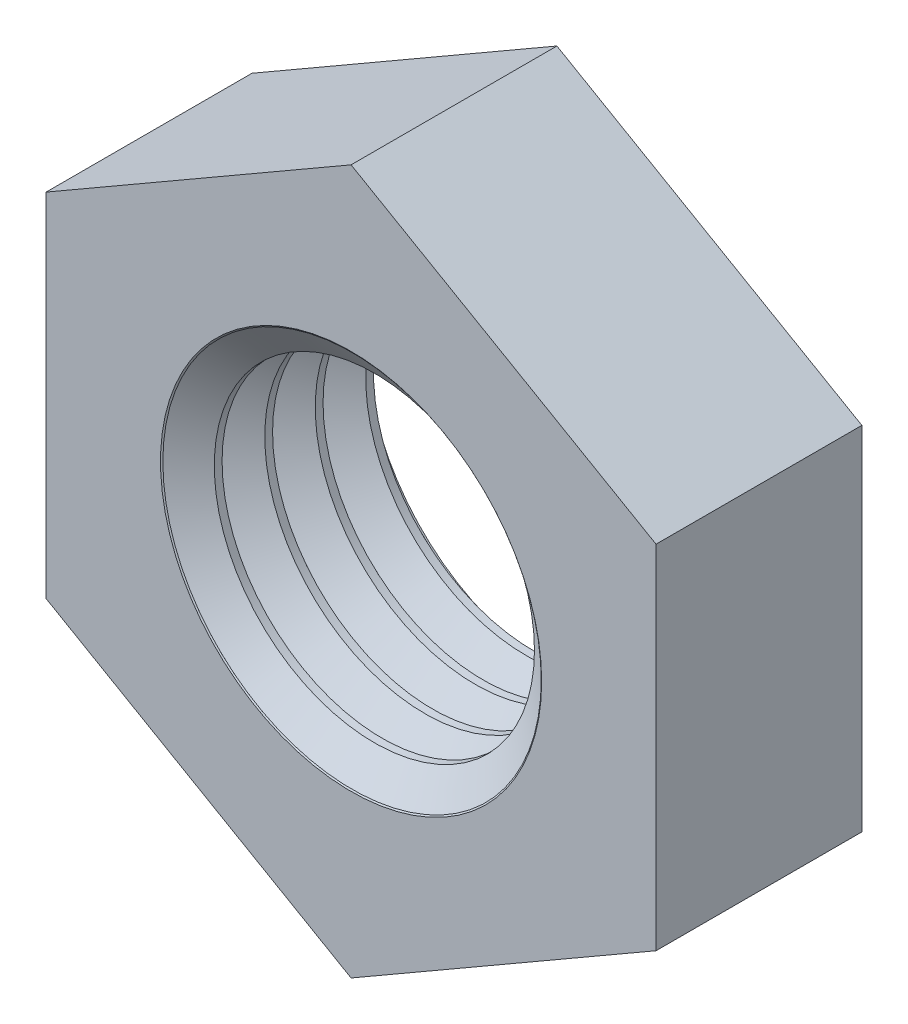
ISO-10303-21;
HEADER;
FILE_DESCRIPTION(('STEP AP214'),'2;1');
FILE_NAME('part.step','',(''),(''),'','','');
FILE_SCHEMA(('AUTOMOTIVE_DESIGN { 1 0 10303 214 1 1 1 1 }'));
ENDSEC;
DATA;
#1=APPLICATION_CONTEXT('core data for automotive mechanical design processes');
#2=APPLICATION_PROTOCOL_DEFINITION('international standard','automotive_design',2000,#1);
#3=PRODUCT_CONTEXT('',#1,'mechanical');
#4=PRODUCT('Part','Part','',(#3));
#5=PRODUCT_RELATED_PRODUCT_CATEGORY('part','',(#4));
#6=PRODUCT_DEFINITION_FORMATION('','',#4);
#7=PRODUCT_DEFINITION_CONTEXT('part definition',#1,'design');
#8=PRODUCT_DEFINITION('design','',#6,#7);
#9=PRODUCT_DEFINITION_SHAPE('','',#8);
#10=(LENGTH_UNIT() NAMED_UNIT(*) SI_UNIT(.MILLI.,.METRE.));
#11=(NAMED_UNIT(*) PLANE_ANGLE_UNIT() SI_UNIT($,.RADIAN.));
#12=(NAMED_UNIT(*) SI_UNIT($,.STERADIAN.) SOLID_ANGLE_UNIT());
#13=UNCERTAINTY_MEASURE_WITH_UNIT(LENGTH_MEASURE(1.E-05),#10,'distance_accuracy_value','');
#14=(GEOMETRIC_REPRESENTATION_CONTEXT(3) GLOBAL_UNCERTAINTY_ASSIGNED_CONTEXT((#13)) GLOBAL_UNIT_ASSIGNED_CONTEXT((#10,
#11,#12)) REPRESENTATION_CONTEXT('',''));
#15=CARTESIAN_POINT('',(0.,0.,0.));
#16=DIRECTION('',(0.,0.,1.));
#17=DIRECTION('',(1.,0.,0.));
#18=AXIS2_PLACEMENT_3D('',#15,#16,#17);
#19=CARTESIAN_POINT('',(0.,0.,-2.7));
#20=DIRECTION('',(0.,0.,1.));
#21=DIRECTION('',(1.,0.,0.));
#22=AXIS2_PLACEMENT_3D('',#19,#20,#21);
#23=CYLINDRICAL_SURFACE('',#22,2.1);
#24=CARTESIAN_POINT('',(0.,0.,-2.29238301528389));
#25=DIRECTION('',(0.,0.,-1.));
#26=DIRECTION('',(-1.,0.,0.));
#27=AXIS2_PLACEMENT_3D('',#24,#25,#26);
#28=CIRCLE('',#27,2.1);
#29=CARTESIAN_POINT('',(2.1,0.,-2.29238301528389));
#30=VERTEX_POINT('',#29);
#31=EDGE_CURVE('E221',#30,#30,#28,.T.);
#32=CARTESIAN_POINT('',(0.,0.,-2.39451698471612));
#33=DIRECTION('',(0.,0.,-1.));
#34=DIRECTION('',(-1.,0.,0.));
#35=AXIS2_PLACEMENT_3D('',#32,#33,#34);
#36=CIRCLE('',#35,2.1);
#37=CARTESIAN_POINT('',(2.1,0.,-2.39451698471611));
#38=VERTEX_POINT('',#37);
#39=EDGE_CURVE('E145',#38,#38,#36,.F.);
#40=CARTESIAN_POINT('',(2.1,0.,-2.29238301528389));
#41=CARTESIAN_POINT('',(2.1,0.,-2.29344691079881));
#42=CARTESIAN_POINT('',(2.1,0.,-2.29451080631372));
#43=CARTESIAN_POINT('',(2.1,0.,-2.29663859734356));
#44=CARTESIAN_POINT('',(2.1,0.,-2.29770249285848));
#45=CARTESIAN_POINT('',(2.1,0.,-2.29983028388832));
#46=CARTESIAN_POINT('',(2.1,0.,-2.30089417940324));
#47=CARTESIAN_POINT('',(2.1,0.,-2.30302197043308));
#48=CARTESIAN_POINT('',(2.1,0.,-2.304085865948));
#49=CARTESIAN_POINT('',(2.1,0.,-2.30621365697783));
#50=CARTESIAN_POINT('',(2.1,0.,-2.30727755249275));
#51=CARTESIAN_POINT('',(2.1,0.,-2.30940534352259));
#52=CARTESIAN_POINT('',(2.1,0.,-2.31046923903751));
#53=CARTESIAN_POINT('',(2.1,0.,-2.31259703006735));
#54=CARTESIAN_POINT('',(2.1,0.,-2.31366092558227));
#55=CARTESIAN_POINT('',(2.1,0.,-2.31578871661211));
#56=CARTESIAN_POINT('',(2.1,0.,-2.31685261212702));
#57=CARTESIAN_POINT('',(2.1,0.,-2.31898040315686));
#58=CARTESIAN_POINT('',(2.1,0.,-2.32004429867178));
#59=CARTESIAN_POINT('',(2.1,0.,-2.32217208970162));
#60=CARTESIAN_POINT('',(2.1,0.,-2.32323598521654));
#61=CARTESIAN_POINT('',(2.1,0.,-2.32536377624638));
#62=CARTESIAN_POINT('',(2.1,0.,-2.3264276717613));
#63=CARTESIAN_POINT('',(2.1,0.,-2.32855546279113));
#64=CARTESIAN_POINT('',(2.1,0.,-2.32961935830605));
#65=CARTESIAN_POINT('',(2.1,0.,-2.33174714933589));
#66=CARTESIAN_POINT('',(2.1,0.,-2.33281104485081));
#67=CARTESIAN_POINT('',(2.1,0.,-2.33493883588065));
#68=CARTESIAN_POINT('',(2.1,0.,-2.33600273139557));
#69=CARTESIAN_POINT('',(2.1,0.,-2.33813052242541));
#70=CARTESIAN_POINT('',(2.1,0.,-2.33919441794033));
#71=CARTESIAN_POINT('',(2.1,0.,-2.34132220897016));
#72=CARTESIAN_POINT('',(2.1,0.,-2.34238610448508));
#73=CARTESIAN_POINT('',(2.1,0.,-2.34451389551492));
#74=CARTESIAN_POINT('',(2.1,0.,-2.34557779102984));
#75=CARTESIAN_POINT('',(2.1,0.,-2.34770558205968));
#76=CARTESIAN_POINT('',(2.1,0.,-2.3487694775746));
#77=CARTESIAN_POINT('',(2.1,0.,-2.35089726860443));
#78=CARTESIAN_POINT('',(2.1,0.,-2.35196116411935));
#79=CARTESIAN_POINT('',(2.1,0.,-2.35408895514919));
#80=CARTESIAN_POINT('',(2.1,0.,-2.35515285066411));
#81=CARTESIAN_POINT('',(2.1,0.,-2.35728064169395));
#82=CARTESIAN_POINT('',(2.1,0.,-2.35834453720887));
#83=CARTESIAN_POINT('',(2.1,0.,-2.36047232823871));
#84=CARTESIAN_POINT('',(2.1,0.,-2.36153622375362));
#85=CARTESIAN_POINT('',(2.1,0.,-2.36366401478346));
#86=CARTESIAN_POINT('',(2.1,0.,-2.36472791029838));
#87=CARTESIAN_POINT('',(2.1,0.,-2.36685570132822));
#88=CARTESIAN_POINT('',(2.1,0.,-2.36791959684314));
#89=CARTESIAN_POINT('',(2.1,0.,-2.37004738787298));
#90=CARTESIAN_POINT('',(2.1,0.,-2.3711112833879));
#91=CARTESIAN_POINT('',(2.1,0.,-2.37323907441773));
#92=CARTESIAN_POINT('',(2.1,0.,-2.37430296993265));
#93=CARTESIAN_POINT('',(2.1,0.,-2.37643076096249));
#94=CARTESIAN_POINT('',(2.1,0.,-2.37749465647741));
#95=CARTESIAN_POINT('',(2.1,0.,-2.37962244750725));
#96=CARTESIAN_POINT('',(2.1,0.,-2.38068634302217));
#97=CARTESIAN_POINT('',(2.1,0.,-2.38281413405201));
#98=CARTESIAN_POINT('',(2.1,0.,-2.38387802956692));
#99=CARTESIAN_POINT('',(2.1,0.,-2.38600582059676));
#100=CARTESIAN_POINT('',(2.1,0.,-2.38706971611168));
#101=CARTESIAN_POINT('',(2.1,0.,-2.38919750714152));
#102=CARTESIAN_POINT('',(2.1,0.,-2.39026140265644));
#103=CARTESIAN_POINT('',(2.1,0.,-2.39238919368628));
#104=CARTESIAN_POINT('',(2.1,0.,-2.3934530892012));
#105=CARTESIAN_POINT('',(2.1,0.,-2.39451698471611));
#106=B_SPLINE_CURVE_WITH_KNOTS('',3,(#40,#41,#42,#43,#44,#45,#46,#47,#48,#49,#50,#51,#52,#53,
#54,#55,#56,#57,#58,#59,#60,#61,#62,#63,#64,#65,#66,#67,#68,#69,#70,#71,#72,#73,#74,#75,#76,#77,
#78,#79,#80,#81,#82,#83,#84,#85,#86,#87,#88,#89,#90,#91,#92,#93,#94,#95,#96,#97,#98,#99,#100,
#101,#102,#103,#104,#105),.UNSPECIFIED.,.F.,.F.,(4,2,2,2,2,2,2,2,2,2,2,2,2,2,2,2,2,2,2,2,2,2,2,
2,2,2,2,2,2,2,2,2,4),(0.,0.00319168654475729,0.00638337308951457,0.00957505963427143,
0.0127667461790287,0.015958432723786,0.0191501192685429,0.0223418058133001,0.025533492358057,
0.0287251789028143,0.0319168654475716,0.0351085519923284,0.0383002385370857,0.0414919250818426,
0.0446836116265999,0.0478752981713571,0.051066984716114,0.0542586712608713,0.0574503578056286,
0.0606420443503854,0.0638337308951427,0.0670254174399,0.0702171039846568,0.0734087905294141,
0.076600477074171,0.0797921636189283,0.0829838501636856,0.0861755367084424,0.0893672232531997,
0.0925589097979566,0.0957505963427138,0.0989422828874711,0.102133969432228),.UNSPECIFIED.);
#107=EDGE_CURVE('BSEAM34',#30,#38,#106,.T.);
#108=ORIENTED_EDGE('',*,*,#31,.F.);
#109=ORIENTED_EDGE('',*,*,#39,.F.);
#110=ORIENTED_EDGE('',*,*,#107,.T.);
#111=ORIENTED_EDGE('',*,*,#107,.F.);
#112=EDGE_LOOP('',(#108,#110,#109,#111));
#113=FACE_BOUND('',#112,.T.);
#114=ADVANCED_FACE('F34',(#113),#23,.F.);
#115=CARTESIAN_POINT('',(0.,0.,-1.73221698471612));
#116=DIRECTION('',(0.,0.,-1.));
#117=DIRECTION('',(-1.,0.,0.));
#118=AXIS2_PLACEMENT_3D('',#115,#116,#117);
#119=CIRCLE('',#118,2.1);
#120=CARTESIAN_POINT('',(2.1,0.,-1.73221698471612));
#121=VERTEX_POINT('',#120);
#122=EDGE_CURVE('E224',#121,#121,#119,.T.);
#123=CARTESIAN_POINT('',(0.,0.,-1.63008301528389));
#124=DIRECTION('',(0.,0.,-1.));
#125=DIRECTION('',(-1.,0.,0.));
#126=AXIS2_PLACEMENT_3D('',#123,#124,#125);
#127=CIRCLE('',#126,2.1);
#128=CARTESIAN_POINT('',(2.1,0.,-1.63008301528389));
#129=VERTEX_POINT('',#128);
#130=EDGE_CURVE('E212',#129,#129,#127,.T.);
#131=CARTESIAN_POINT('',(2.1,0.,-1.73221698471612));
#132=CARTESIAN_POINT('',(2.1,0.,-1.7311530892012));
#133=CARTESIAN_POINT('',(2.1,0.,-1.73008919368628));
#134=CARTESIAN_POINT('',(2.1,0.,-1.72796140265645));
#135=CARTESIAN_POINT('',(2.1,0.,-1.72689750714153));
#136=CARTESIAN_POINT('',(2.1,0.,-1.72476971611169));
#137=CARTESIAN_POINT('',(2.1,0.,-1.72370582059677));
#138=CARTESIAN_POINT('',(2.1,0.,-1.72157802956693));
#139=CARTESIAN_POINT('',(2.1,0.,-1.72051413405201));
#140=CARTESIAN_POINT('',(2.1,0.,-1.71838634302217));
#141=CARTESIAN_POINT('',(2.1,0.,-1.71732244750725));
#142=CARTESIAN_POINT('',(2.1,0.,-1.71519465647742));
#143=CARTESIAN_POINT('',(2.1,0.,-1.7141307609625));
#144=CARTESIAN_POINT('',(2.1,0.,-1.71200296993266));
#145=CARTESIAN_POINT('',(2.1,0.,-1.71093907441774));
#146=CARTESIAN_POINT('',(2.1,0.,-1.7088112833879));
#147=CARTESIAN_POINT('',(2.1,0.,-1.70774738787298));
#148=CARTESIAN_POINT('',(2.1,0.,-1.70561959684314));
#149=CARTESIAN_POINT('',(2.1,0.,-1.70455570132822));
#150=CARTESIAN_POINT('',(2.1,0.,-1.70242791029839));
#151=CARTESIAN_POINT('',(2.1,0.,-1.70136401478347));
#152=CARTESIAN_POINT('',(2.1,0.,-1.69923622375363));
#153=CARTESIAN_POINT('',(2.1,0.,-1.69817232823871));
#154=CARTESIAN_POINT('',(2.1,0.,-1.69604453720887));
#155=CARTESIAN_POINT('',(2.1,0.,-1.69498064169395));
#156=CARTESIAN_POINT('',(2.1,0.,-1.69285285066411));
#157=CARTESIAN_POINT('',(2.1,0.,-1.6917889551492));
#158=CARTESIAN_POINT('',(2.1,0.,-1.68966116411936));
#159=CARTESIAN_POINT('',(2.1,0.,-1.68859726860444));
#160=CARTESIAN_POINT('',(2.1,0.,-1.6864694775746));
#161=CARTESIAN_POINT('',(2.1,0.,-1.68540558205968));
#162=CARTESIAN_POINT('',(2.1,0.,-1.68327779102984));
#163=CARTESIAN_POINT('',(2.1,0.,-1.68221389551492));
#164=CARTESIAN_POINT('',(2.1,0.,-1.68008610448509));
#165=CARTESIAN_POINT('',(2.1,0.,-1.67902220897017));
#166=CARTESIAN_POINT('',(2.1,0.,-1.67689441794033));
#167=CARTESIAN_POINT('',(2.1,0.,-1.67583052242541));
#168=CARTESIAN_POINT('',(2.1,0.,-1.67370273139557));
#169=CARTESIAN_POINT('',(2.1,0.,-1.67263883588065));
#170=CARTESIAN_POINT('',(2.1,0.,-1.67051104485081));
#171=CARTESIAN_POINT('',(2.1,0.,-1.66944714933589));
#172=CARTESIAN_POINT('',(2.1,0.,-1.66731935830606));
#173=CARTESIAN_POINT('',(2.1,0.,-1.66625546279114));
#174=CARTESIAN_POINT('',(2.1,0.,-1.6641276717613));
#175=CARTESIAN_POINT('',(2.1,0.,-1.66306377624638));
#176=CARTESIAN_POINT('',(2.1,0.,-1.66093598521654));
#177=CARTESIAN_POINT('',(2.1,0.,-1.65987208970162));
#178=CARTESIAN_POINT('',(2.1,0.,-1.65774429867178));
#179=CARTESIAN_POINT('',(2.1,0.,-1.65668040315687));
#180=CARTESIAN_POINT('',(2.1,0.,-1.65455261212703));
#181=CARTESIAN_POINT('',(2.1,0.,-1.65348871661211));
#182=CARTESIAN_POINT('',(2.1,0.,-1.65136092558227));
#183=CARTESIAN_POINT('',(2.1,0.,-1.65029703006735));
#184=CARTESIAN_POINT('',(2.1,0.,-1.64816923903751));
#185=CARTESIAN_POINT('',(2.1,0.,-1.64710534352259));
#186=CARTESIAN_POINT('',(2.1,0.,-1.64497755249275));
#187=CARTESIAN_POINT('',(2.1,0.,-1.64391365697784));
#188=CARTESIAN_POINT('',(2.1,0.,-1.641785865948));
#189=CARTESIAN_POINT('',(2.1,0.,-1.64072197043308));
#190=CARTESIAN_POINT('',(2.1,0.,-1.63859417940324));
#191=CARTESIAN_POINT('',(2.1,0.,-1.63753028388832));
#192=CARTESIAN_POINT('',(2.1,0.,-1.63540249285848));
#193=CARTESIAN_POINT('',(2.1,0.,-1.63433859734356));
#194=CARTESIAN_POINT('',(2.1,0.,-1.63221080631373));
#195=CARTESIAN_POINT('',(2.1,0.,-1.63114691079881));
#196=CARTESIAN_POINT('',(2.1,0.,-1.63008301528389));
#197=B_SPLINE_CURVE_WITH_KNOTS('',3,(#131,#132,#133,#134,#135,#136,#137,#138,#139,#140,#141,
#142,#143,#144,#145,#146,#147,#148,#149,#150,#151,#152,#153,#154,#155,#156,#157,#158,#159,#160,
#161,#162,#163,#164,#165,#166,#167,#168,#169,#170,#171,#172,#173,#174,#175,#176,#177,#178,#179,
#180,#181,#182,#183,#184,#185,#186,#187,#188,#189,#190,#191,#192,#193,#194,#195,#196),
.UNSPECIFIED.,.F.,.F.,(4,2,2,2,2,2,2,2,2,2,2,2,2,2,2,2,2,2,2,2,2,2,2,2,2,2,2,2,2,2,2,2,4),(0.,
0.00319168654475729,0.00638337308951457,0.00957505963427186,0.0127667461790291,
0.0159584327237864,0.0191501192685437,0.022341805813301,0.0255334923580585,0.0287251789028158,
0.0319168654475731,0.0351085519923304,0.0383002385370877,0.0414919250818449,0.0446836116266024,
0.0478752981713597,0.051066984716117,0.0542586712608743,0.0574503578056316,0.0606420443503891,
0.0638337308951464,0.0670254174399037,0.070217103984661,0.0734087905294182,0.0766004770741755,
0.079792163618933,0.0829838501636903,0.0861755367084476,0.0893672232532049,0.0925589097979622,
0.0957505963427197,0.098942282887477,0.102133969432234),.UNSPECIFIED.);
#198=EDGE_CURVE('BSEAM172',#121,#129,#197,.T.);
#199=ORIENTED_EDGE('',*,*,#122,.T.);
#200=ORIENTED_EDGE('',*,*,#130,.F.);
#201=ORIENTED_EDGE('',*,*,#198,.T.);
#202=ORIENTED_EDGE('',*,*,#198,.F.);
#203=EDGE_LOOP('',(#199,#201,#200,#202));
#204=FACE_BOUND('',#203,.T.);
#205=ADVANCED_FACE('F172',(#204),#23,.F.);
#206=CARTESIAN_POINT('',(0.,0.,-1.06991698471612));
#207=DIRECTION('',(0.,0.,-1.));
#208=DIRECTION('',(-1.,0.,0.));
#209=AXIS2_PLACEMENT_3D('',#206,#207,#208);
#210=CIRCLE('',#209,2.1);
#211=CARTESIAN_POINT('',(2.1,0.,-1.06991698471612));
#212=VERTEX_POINT('',#211);
#213=EDGE_CURVE('E215',#212,#212,#210,.T.);
#214=CARTESIAN_POINT('',(0.,0.,-0.967783015283887));
#215=DIRECTION('',(0.,0.,-1.));
#216=DIRECTION('',(-1.,0.,0.));
#217=AXIS2_PLACEMENT_3D('',#214,#215,#216);
#218=CIRCLE('',#217,2.1);
#219=CARTESIAN_POINT('',(2.1,0.,-0.967783015283887));
#220=VERTEX_POINT('',#219);
#221=EDGE_CURVE('E203',#220,#220,#218,.T.);
#222=CARTESIAN_POINT('',(2.1,0.,-1.06991698471612));
#223=CARTESIAN_POINT('',(2.1,0.,-1.0688530892012));
#224=CARTESIAN_POINT('',(2.1,0.,-1.06778919368628));
#225=CARTESIAN_POINT('',(2.1,0.,-1.06566140265645));
#226=CARTESIAN_POINT('',(2.1,0.,-1.06459750714153));
#227=CARTESIAN_POINT('',(2.1,0.,-1.06246971611169));
#228=CARTESIAN_POINT('',(2.1,0.,-1.06140582059677));
#229=CARTESIAN_POINT('',(2.1,0.,-1.05927802956693));
#230=CARTESIAN_POINT('',(2.1,0.,-1.05821413405201));
#231=CARTESIAN_POINT('',(2.1,0.,-1.05608634302217));
#232=CARTESIAN_POINT('',(2.1,0.,-1.05502244750725));
#233=CARTESIAN_POINT('',(2.1,0.,-1.05289465647742));
#234=CARTESIAN_POINT('',(2.1,0.,-1.0518307609625));
#235=CARTESIAN_POINT('',(2.1,0.,-1.04970296993266));
#236=CARTESIAN_POINT('',(2.1,0.,-1.04863907441774));
#237=CARTESIAN_POINT('',(2.1,0.,-1.0465112833879));
#238=CARTESIAN_POINT('',(2.1,0.,-1.04544738787298));
#239=CARTESIAN_POINT('',(2.1,0.,-1.04331959684314));
#240=CARTESIAN_POINT('',(2.1,0.,-1.04225570132822));
#241=CARTESIAN_POINT('',(2.1,0.,-1.04012791029839));
#242=CARTESIAN_POINT('',(2.1,0.,-1.03906401478347));
#243=CARTESIAN_POINT('',(2.1,0.,-1.03693622375363));
#244=CARTESIAN_POINT('',(2.1,0.,-1.03587232823871));
#245=CARTESIAN_POINT('',(2.1,0.,-1.03374453720887));
#246=CARTESIAN_POINT('',(2.1,0.,-1.03268064169395));
#247=CARTESIAN_POINT('',(2.1,0.,-1.03055285066412));
#248=CARTESIAN_POINT('',(2.1,0.,-1.0294889551492));
#249=CARTESIAN_POINT('',(2.1,0.,-1.02736116411936));
#250=CARTESIAN_POINT('',(2.1,0.,-1.02629726860444));
#251=CARTESIAN_POINT('',(2.1,0.,-1.0241694775746));
#252=CARTESIAN_POINT('',(2.1,0.,-1.02310558205968));
#253=CARTESIAN_POINT('',(2.1,0.,-1.02097779102984));
#254=CARTESIAN_POINT('',(2.1,0.,-1.01991389551492));
#255=CARTESIAN_POINT('',(2.1,0.,-1.01778610448509));
#256=CARTESIAN_POINT('',(2.1,0.,-1.01672220897017));
#257=CARTESIAN_POINT('',(2.1,0.,-1.01459441794033));
#258=CARTESIAN_POINT('',(2.1,0.,-1.01353052242541));
#259=CARTESIAN_POINT('',(2.1,0.,-1.01140273139557));
#260=CARTESIAN_POINT('',(2.1,0.,-1.01033883588065));
#261=CARTESIAN_POINT('',(2.1,0.,-1.00821104485081));
#262=CARTESIAN_POINT('',(2.1,0.,-1.00714714933589));
#263=CARTESIAN_POINT('',(2.1,0.,-1.00501935830606));
#264=CARTESIAN_POINT('',(2.1,0.,-1.00395546279114));
#265=CARTESIAN_POINT('',(2.1,0.,-1.0018276717613));
#266=CARTESIAN_POINT('',(2.1,0.,-1.00076377624638));
#267=CARTESIAN_POINT('',(2.1,0.,-0.998635985216542));
#268=CARTESIAN_POINT('',(2.1,0.,-0.997572089701623));
#269=CARTESIAN_POINT('',(2.1,0.,-0.995444298671784));
#270=CARTESIAN_POINT('',(2.1,0.,-0.994380403156865));
#271=CARTESIAN_POINT('',(2.1,0.,-0.992252612127027));
#272=CARTESIAN_POINT('',(2.1,0.,-0.991188716612108));
#273=CARTESIAN_POINT('',(2.1,0.,-0.98906092558227));
#274=CARTESIAN_POINT('',(2.1,0.,-0.987997030067351));
#275=CARTESIAN_POINT('',(2.1,0.,-0.985869239037512));
#276=CARTESIAN_POINT('',(2.1,0.,-0.984805343522593));
#277=CARTESIAN_POINT('',(2.1,0.,-0.982677552492755));
#278=CARTESIAN_POINT('',(2.1,0.,-0.981613656977836));
#279=CARTESIAN_POINT('',(2.1,0.,-0.979485865947998));
#280=CARTESIAN_POINT('',(2.1,0.,-0.978421970433079));
#281=CARTESIAN_POINT('',(2.1,0.,-0.97629417940324));
#282=CARTESIAN_POINT('',(2.1,0.,-0.975230283888321));
#283=CARTESIAN_POINT('',(2.1,0.,-0.973102492858483));
#284=CARTESIAN_POINT('',(2.1,0.,-0.972038597343564));
#285=CARTESIAN_POINT('',(2.1,0.,-0.969910806313726));
#286=CARTESIAN_POINT('',(2.1,0.,-0.968846910798807));
#287=CARTESIAN_POINT('',(2.1,0.,-0.967783015283887));
#288=B_SPLINE_CURVE_WITH_KNOTS('',3,(#222,#223,#224,#225,#226,#227,#228,#229,#230,#231,#232,
#233,#234,#235,#236,#237,#238,#239,#240,#241,#242,#243,#244,#245,#246,#247,#248,#249,#250,#251,
#252,#253,#254,#255,#256,#257,#258,#259,#260,#261,#262,#263,#264,#265,#266,#267,#268,#269,#270,
#271,#272,#273,#274,#275,#276,#277,#278,#279,#280,#281,#282,#283,#284,#285,#286,#287),
.UNSPECIFIED.,.F.,.F.,(4,2,2,2,2,2,2,2,2,2,2,2,2,2,2,2,2,2,2,2,2,2,2,2,2,2,2,2,2,2,2,2,4),(0.,
0.00319168654475729,0.00638337308951457,0.00957505963427208,0.0127667461790294,
0.0159584327237867,0.0191501192685439,0.0223418058133012,0.0255334923580587,0.028725178902816,
0.0319168654475733,0.0351085519923306,0.0383002385370879,0.0414919250818452,0.0446836116266027,
0.04787529817136,0.0510669847161172,0.0542586712608745,0.0574503578056318,0.0606420443503893,
0.0638337308951466,0.0670254174399039,0.0702171039846612,0.0734087905294185,0.0766004770741757,
0.0797921636189333,0.0829838501636905,0.0861755367084478,0.0893672232532051,0.0925589097979624,
0.0957505963427199,0.0989422828874772,0.102133969432234),.UNSPECIFIED.);
#289=EDGE_CURVE('BSEAM178',#212,#220,#288,.T.);
#290=ORIENTED_EDGE('',*,*,#213,.T.);
#291=ORIENTED_EDGE('',*,*,#221,.F.);
#292=ORIENTED_EDGE('',*,*,#289,.T.);
#293=ORIENTED_EDGE('',*,*,#289,.F.);
#294=EDGE_LOOP('',(#290,#292,#291,#293));
#295=FACE_BOUND('',#294,.T.);
#296=ADVANCED_FACE('F178',(#295),#23,.F.);
#297=CARTESIAN_POINT('',(0.,0.,-0.407616984716122));
#298=DIRECTION('',(0.,0.,-1.));
#299=DIRECTION('',(-1.,0.,0.));
#300=AXIS2_PLACEMENT_3D('',#297,#298,#299);
#301=CIRCLE('',#300,2.1);
#302=CARTESIAN_POINT('',(2.1,0.,-0.407616984716122));
#303=VERTEX_POINT('',#302);
#304=EDGE_CURVE('E193',#303,#303,#301,.T.);
#305=CARTESIAN_POINT('',(0.,0.,-0.305483015283887));
#306=DIRECTION('',(0.,0.,-1.));
#307=DIRECTION('',(-1.,0.,0.));
#308=AXIS2_PLACEMENT_3D('',#305,#306,#307);
#309=CIRCLE('',#308,2.1);
#310=CARTESIAN_POINT('',(2.1,0.,-0.305483015283887));
#311=VERTEX_POINT('',#310);
#312=EDGE_CURVE('E196',#311,#311,#309,.T.);
#313=CARTESIAN_POINT('',(2.1,0.,-0.407616984716122));
#314=CARTESIAN_POINT('',(2.1,0.,-0.406553089201203));
#315=CARTESIAN_POINT('',(2.1,0.,-0.405489193686284));
#316=CARTESIAN_POINT('',(2.1,0.,-0.403361402656446));
#317=CARTESIAN_POINT('',(2.1,0.,-0.402297507141527));
#318=CARTESIAN_POINT('',(2.1,0.,-0.400169716111688));
#319=CARTESIAN_POINT('',(2.1,0.,-0.399105820596769));
#320=CARTESIAN_POINT('',(2.1,0.,-0.396978029566931));
#321=CARTESIAN_POINT('',(2.1,0.,-0.395914134052012));
#322=CARTESIAN_POINT('',(2.1,0.,-0.393786343022174));
#323=CARTESIAN_POINT('',(2.1,0.,-0.392722447507254));
#324=CARTESIAN_POINT('',(2.1,0.,-0.390594656477416));
#325=CARTESIAN_POINT('',(2.1,0.,-0.389530760962497));
#326=CARTESIAN_POINT('',(2.1,0.,-0.387402969932659));
#327=CARTESIAN_POINT('',(2.1,0.,-0.38633907441774));
#328=CARTESIAN_POINT('',(2.1,0.,-0.384211283387901));
#329=CARTESIAN_POINT('',(2.1,0.,-0.383147387872982));
#330=CARTESIAN_POINT('',(2.1,0.,-0.381019596843144));
#331=CARTESIAN_POINT('',(2.1,0.,-0.379955701328225));
#332=CARTESIAN_POINT('',(2.1,0.,-0.377827910298387));
#333=CARTESIAN_POINT('',(2.1,0.,-0.376764014783468));
#334=CARTESIAN_POINT('',(2.1,0.,-0.37463622375363));
#335=CARTESIAN_POINT('',(2.1,0.,-0.373572328238711));
#336=CARTESIAN_POINT('',(2.1,0.,-0.371444537208872));
#337=CARTESIAN_POINT('',(2.1,0.,-0.370380641693953));
#338=CARTESIAN_POINT('',(2.1,0.,-0.368252850664115));
#339=CARTESIAN_POINT('',(2.1,0.,-0.367188955149195));
#340=CARTESIAN_POINT('',(2.1,0.,-0.365061164119357));
#341=CARTESIAN_POINT('',(2.1,0.,-0.363997268604438));
#342=CARTESIAN_POINT('',(2.1,0.,-0.3618694775746));
#343=CARTESIAN_POINT('',(2.1,0.,-0.360805582059681));
#344=CARTESIAN_POINT('',(2.1,0.,-0.358677791029843));
#345=CARTESIAN_POINT('',(2.1,0.,-0.357613895514924));
#346=CARTESIAN_POINT('',(2.1,0.,-0.355486104485085));
#347=CARTESIAN_POINT('',(2.1,0.,-0.354422208970166));
#348=CARTESIAN_POINT('',(2.1,0.,-0.352294417940328));
#349=CARTESIAN_POINT('',(2.1,0.,-0.351230522425409));
#350=CARTESIAN_POINT('',(2.1,0.,-0.349102731395571));
#351=CARTESIAN_POINT('',(2.1,0.,-0.348038835880652));
#352=CARTESIAN_POINT('',(2.1,0.,-0.345911044850814));
#353=CARTESIAN_POINT('',(2.1,0.,-0.344847149335894));
#354=CARTESIAN_POINT('',(2.1,0.,-0.342719358306056));
#355=CARTESIAN_POINT('',(2.1,0.,-0.341655462791137));
#356=CARTESIAN_POINT('',(2.1,0.,-0.339527671761299));
#357=CARTESIAN_POINT('',(2.1,0.,-0.338463776246379));
#358=CARTESIAN_POINT('',(2.1,0.,-0.336335985216541));
#359=CARTESIAN_POINT('',(2.1,0.,-0.335272089701622));
#360=CARTESIAN_POINT('',(2.1,0.,-0.333144298671784));
#361=CARTESIAN_POINT('',(2.1,0.,-0.332080403156865));
#362=CARTESIAN_POINT('',(2.1,0.,-0.329952612127027));
#363=CARTESIAN_POINT('',(2.1,0.,-0.328888716612108));
#364=CARTESIAN_POINT('',(2.1,0.,-0.326760925582269));
#365=CARTESIAN_POINT('',(2.1,0.,-0.32569703006735));
#366=CARTESIAN_POINT('',(2.1,0.,-0.323569239037512));
#367=CARTESIAN_POINT('',(2.1,0.,-0.322505343522593));
#368=CARTESIAN_POINT('',(2.1,0.,-0.320377552492755));
#369=CARTESIAN_POINT('',(2.1,0.,-0.319313656977835));
#370=CARTESIAN_POINT('',(2.1,0.,-0.317185865947997));
#371=CARTESIAN_POINT('',(2.1,0.,-0.316121970433078));
#372=CARTESIAN_POINT('',(2.1,0.,-0.31399417940324));
#373=CARTESIAN_POINT('',(2.1,0.,-0.312930283888321));
#374=CARTESIAN_POINT('',(2.1,0.,-0.310802492858483));
#375=CARTESIAN_POINT('',(2.1,0.,-0.309738597343563));
#376=CARTESIAN_POINT('',(2.1,0.,-0.307610806313725));
#377=CARTESIAN_POINT('',(2.1,0.,-0.306546910798806));
#378=CARTESIAN_POINT('',(2.1,0.,-0.305483015283887));
#379=B_SPLINE_CURVE_WITH_KNOTS('',3,(#313,#314,#315,#316,#317,#318,#319,#320,#321,#322,#323,
#324,#325,#326,#327,#328,#329,#330,#331,#332,#333,#334,#335,#336,#337,#338,#339,#340,#341,#342,
#343,#344,#345,#346,#347,#348,#349,#350,#351,#352,#353,#354,#355,#356,#357,#358,#359,#360,#361,
#362,#363,#364,#365,#366,#367,#368,#369,#370,#371,#372,#373,#374,#375,#376,#377,#378),
.UNSPECIFIED.,.F.,.F.,(4,2,2,2,2,2,2,2,2,2,2,2,2,2,2,2,2,2,2,2,2,2,2,2,2,2,2,2,2,2,2,2,4),(0.,
0.00319168654475729,0.00638337308951457,0.00957505963427186,0.0127667461790291,
0.0159584327237869,0.0191501192685442,0.0223418058133014,0.0255334923580587,0.028725178902816,
0.0319168654475733,0.0351085519923306,0.0383002385370883,0.0414919250818456,0.0446836116266029,
0.0478752981713602,0.0510669847161175,0.0542586712608747,0.057450357805632,0.0606420443503893,
0.0638337308951466,0.0670254174399043,0.0702171039846616,0.0734087905294189,0.0766004770741762,
0.0797921636189335,0.0829838501636908,0.086175536708448,0.0893672232532058,0.0925589097979631,
0.0957505963427203,0.0989422828874776,0.102133969432235),.UNSPECIFIED.);
#380=EDGE_CURVE('BSEAM169',#303,#311,#379,.T.);
#381=ORIENTED_EDGE('',*,*,#304,.T.);
#382=ORIENTED_EDGE('',*,*,#312,.F.);
#383=ORIENTED_EDGE('',*,*,#380,.T.);
#384=ORIENTED_EDGE('',*,*,#380,.F.);
#385=EDGE_LOOP('',(#381,#383,#382,#384));
#386=FACE_BOUND('',#385,.T.);
#387=ADVANCED_FACE('F169',(#386),#23,.F.);
#388=CARTESIAN_POINT('',(0.,4.61880215351702,-2.7));
#389=DIRECTION('',(-0.500000000000006,0.866025403784435,0.));
#390=DIRECTION('',(-0.866025403784436,-0.500000000000006,0.));
#391=AXIS2_PLACEMENT_3D('',#388,#389,#390);
#392=PLANE('',#391);
#393=DIRECTION('',(-0.866025403784435,-0.500000000000006,0.));
#394=VECTOR('',#393,1.);
#395=CARTESIAN_POINT('',(0.,4.61880215351702,0.));
#396=LINE('',#395,#394);
#397=CARTESIAN_POINT('',(0.,4.61880215351702,0.));
#398=VERTEX_POINT('',#397);
#399=CARTESIAN_POINT('',(-4.,2.30940107675848,0.));
#400=VERTEX_POINT('',#399);
#401=EDGE_CURVE('E121',#398,#400,#396,.T.);
#402=ORIENTED_EDGE('',*,*,#401,.F.);
#403=DIRECTION('',(0.,0.,1.));
#404=VECTOR('',#403,1.);
#405=CARTESIAN_POINT('',(0.,4.61880215351702,-2.7));
#406=LINE('',#405,#404);
#407=CARTESIAN_POINT('',(0.,4.61880215351702,-2.7));
#408=VERTEX_POINT('',#407);
#409=EDGE_CURVE('E11',#408,#398,#406,.T.);
#410=ORIENTED_EDGE('',*,*,#409,.F.);
#411=DIRECTION('',(-0.866025403784435,-0.500000000000006,0.));
#412=VECTOR('',#411,1.);
#413=CARTESIAN_POINT('',(0.,4.61880215351702,-2.7));
#414=LINE('',#413,#412);
#415=CARTESIAN_POINT('',(-4.,2.30940107675848,-2.7));
#416=VERTEX_POINT('',#415);
#417=EDGE_CURVE('E136',#408,#416,#414,.T.);
#418=ORIENTED_EDGE('',*,*,#417,.T.);
#419=DIRECTION('',(0.,0.,1.));
#420=VECTOR('',#419,1.);
#421=CARTESIAN_POINT('',(-4.,2.30940107675848,-2.7));
#422=LINE('',#421,#420);
#423=EDGE_CURVE('E85',#416,#400,#422,.T.);
#424=ORIENTED_EDGE('',*,*,#423,.T.);
#425=EDGE_LOOP('',(#402,#410,#418,#424));
#426=FACE_BOUND('',#425,.T.);
#427=ADVANCED_FACE('F36',(#426),#392,.T.);
#428=CARTESIAN_POINT('',(4.,2.30940107675849,-2.7));
#429=DIRECTION('',(0.500000000000004,0.866025403784436,0.));
#430=DIRECTION('',(-0.866025403784436,0.500000000000004,0.));
#431=AXIS2_PLACEMENT_3D('',#428,#429,#430);
#432=PLANE('',#431);
#433=DIRECTION('',(-0.866025403784436,0.500000000000004,0.));
#434=VECTOR('',#433,1.);
#435=CARTESIAN_POINT('',(4.,2.30940107675849,0.));
#436=LINE('',#435,#434);
#437=CARTESIAN_POINT('',(4.,2.30940107675849,0.));
#438=VERTEX_POINT('',#437);
#439=EDGE_CURVE('E134',#438,#398,#436,.T.);
#440=ORIENTED_EDGE('',*,*,#439,.F.);
#441=DIRECTION('',(0.,0.,1.));
#442=VECTOR('',#441,1.);
#443=CARTESIAN_POINT('',(4.,2.30940107675849,-2.7));
#444=LINE('',#443,#442);
#445=CARTESIAN_POINT('',(4.,2.30940107675849,-2.7));
#446=VERTEX_POINT('',#445);
#447=EDGE_CURVE('E44',#446,#438,#444,.T.);
#448=ORIENTED_EDGE('',*,*,#447,.F.);
#449=DIRECTION('',(-0.866025403784436,0.500000000000004,0.));
#450=VECTOR('',#449,1.);
#451=CARTESIAN_POINT('',(4.,2.30940107675849,-2.7));
#452=LINE('',#451,#450);
#453=EDGE_CURVE('E103',#446,#408,#452,.T.);
#454=ORIENTED_EDGE('',*,*,#453,.T.);
#455=ORIENTED_EDGE('',*,*,#409,.T.);
#456=EDGE_LOOP('',(#440,#448,#454,#455));
#457=FACE_BOUND('',#456,.T.);
#458=ADVANCED_FACE('F161',(#457),#432,.T.);
#459=CARTESIAN_POINT('',(4.,2.30940107675849,-2.7));
#460=DIRECTION('',(-1.,0.,0.));
#461=DIRECTION('',(0.,0.,1.));
#462=AXIS2_PLACEMENT_3D('',#459,#460,#461);
#463=PLANE('',#462);
#464=DIRECTION('',(0.,-1.,0.));
#465=VECTOR('',#464,1.);
#466=CARTESIAN_POINT('',(4.,2.30940107675849,0.));
#467=LINE('',#466,#465);
#468=CARTESIAN_POINT('',(4.,-2.30940107675853,0.));
#469=VERTEX_POINT('',#468);
#470=EDGE_CURVE('E107',#438,#469,#467,.T.);
#471=ORIENTED_EDGE('',*,*,#470,.T.);
#472=DIRECTION('',(0.,0.,1.));
#473=VECTOR('',#472,1.);
#474=CARTESIAN_POINT('',(4.,-2.30940107675853,-2.7));
#475=LINE('',#474,#473);
#476=CARTESIAN_POINT('',(4.,-2.30940107675853,-2.7));
#477=VERTEX_POINT('',#476);
#478=EDGE_CURVE('E105',#477,#469,#475,.T.);
#479=ORIENTED_EDGE('',*,*,#478,.F.);
#480=DIRECTION('',(0.,-1.,0.));
#481=VECTOR('',#480,1.);
#482=CARTESIAN_POINT('',(4.,2.30940107675849,-2.7));
#483=LINE('',#482,#481);
#484=EDGE_CURVE('E96',#446,#477,#483,.T.);
#485=ORIENTED_EDGE('',*,*,#484,.F.);
#486=ORIENTED_EDGE('',*,*,#447,.T.);
#487=EDGE_LOOP('',(#471,#479,#485,#486));
#488=FACE_BOUND('',#487,.T.);
#489=ADVANCED_FACE('F106',(#488),#463,.F.);
#490=CARTESIAN_POINT('',(0.,-4.61880215351707,-2.7));
#491=DIRECTION('',(0.500000000000006,-0.866025403784435,0.));
#492=DIRECTION('',(0.866025403784435,0.500000000000006,0.));
#493=AXIS2_PLACEMENT_3D('',#490,#491,#492);
#494=PLANE('',#493);
#495=DIRECTION('',(0.866025403784435,0.500000000000006,0.));
#496=VECTOR('',#495,1.);
#497=CARTESIAN_POINT('',(0.,-4.61880215351707,0.));
#498=LINE('',#497,#496);
#499=CARTESIAN_POINT('',(0.,-4.61880215351707,0.));
#500=VERTEX_POINT('',#499);
#501=EDGE_CURVE('E131',#500,#469,#498,.T.);
#502=ORIENTED_EDGE('',*,*,#501,.F.);
#503=DIRECTION('',(0.,0.,1.));
#504=VECTOR('',#503,1.);
#505=CARTESIAN_POINT('',(0.,-4.61880215351707,-2.7));
#506=LINE('',#505,#504);
#507=CARTESIAN_POINT('',(0.,-4.61880215351707,-2.7));
#508=VERTEX_POINT('',#507);
#509=EDGE_CURVE('E111',#508,#500,#506,.T.);
#510=ORIENTED_EDGE('',*,*,#509,.F.);
#511=DIRECTION('',(0.866025403784435,0.500000000000006,0.));
#512=VECTOR('',#511,1.);
#513=CARTESIAN_POINT('',(0.,-4.61880215351707,-2.7));
#514=LINE('',#513,#512);
#515=EDGE_CURVE('E101',#508,#477,#514,.T.);
#516=ORIENTED_EDGE('',*,*,#515,.T.);
#517=ORIENTED_EDGE('',*,*,#478,.T.);
#518=EDGE_LOOP('',(#502,#510,#516,#517));
#519=FACE_BOUND('',#518,.T.);
#520=ADVANCED_FACE('F113',(#519),#494,.T.);
#521=CARTESIAN_POINT('',(-4.,-2.30940107675854,-2.7));
#522=DIRECTION('',(-0.500000000000005,-0.866025403784436,0.));
#523=DIRECTION('',(0.866025403784436,-0.500000000000005,0.));
#524=AXIS2_PLACEMENT_3D('',#521,#522,#523);
#525=PLANE('',#524);
#526=DIRECTION('',(0.866025403784436,-0.500000000000004,0.));
#527=VECTOR('',#526,1.);
#528=CARTESIAN_POINT('',(-4.,-2.30940107675854,0.));
#529=LINE('',#528,#527);
#530=CARTESIAN_POINT('',(-4.,-2.30940107675854,0.));
#531=VERTEX_POINT('',#530);
#532=EDGE_CURVE('E128',#531,#500,#529,.T.);
#533=ORIENTED_EDGE('',*,*,#532,.F.);
#534=DIRECTION('',(0.,0.,1.));
#535=VECTOR('',#534,1.);
#536=CARTESIAN_POINT('',(-4.,-2.30940107675854,-2.7));
#537=LINE('',#536,#535);
#538=CARTESIAN_POINT('',(-4.,-2.30940107675854,-2.7));
#539=VERTEX_POINT('',#538);
#540=EDGE_CURVE('E140',#539,#531,#537,.T.);
#541=ORIENTED_EDGE('',*,*,#540,.F.);
#542=DIRECTION('',(0.866025403784436,-0.500000000000004,0.));
#543=VECTOR('',#542,1.);
#544=CARTESIAN_POINT('',(-4.,-2.30940107675854,-2.7));
#545=LINE('',#544,#543);
#546=EDGE_CURVE('E114',#539,#508,#545,.T.);
#547=ORIENTED_EDGE('',*,*,#546,.T.);
#548=ORIENTED_EDGE('',*,*,#509,.T.);
#549=EDGE_LOOP('',(#533,#541,#547,#548));
#550=FACE_BOUND('',#549,.T.);
#551=ADVANCED_FACE('F291',(#550),#525,.T.);
#552=CARTESIAN_POINT('',(-4.,2.30940107675848,-2.7));
#553=DIRECTION('',(-1.,0.,0.));
#554=DIRECTION('',(0.,0.,1.));
#555=AXIS2_PLACEMENT_3D('',#552,#553,#554);
#556=PLANE('',#555);
#557=DIRECTION('',(0.,-1.,0.));
#558=VECTOR('',#557,1.);
#559=CARTESIAN_POINT('',(-4.,2.30940107675848,0.));
#560=LINE('',#559,#558);
#561=EDGE_CURVE('E124',#400,#531,#560,.T.);
#562=ORIENTED_EDGE('',*,*,#561,.F.);
#563=ORIENTED_EDGE('',*,*,#423,.F.);
#564=DIRECTION('',(0.,-1.,0.));
#565=VECTOR('',#564,1.);
#566=CARTESIAN_POINT('',(-4.,2.30940107675848,-2.7));
#567=LINE('',#566,#565);
#568=EDGE_CURVE('E116',#416,#539,#567,.T.);
#569=ORIENTED_EDGE('',*,*,#568,.T.);
#570=ORIENTED_EDGE('',*,*,#540,.T.);
#571=EDGE_LOOP('',(#562,#563,#569,#570));
#572=FACE_BOUND('',#571,.T.);
#573=ADVANCED_FACE('F157',(#572),#556,.T.);
#574=CARTESIAN_POINT('',(-7.99999999999996,0.,-2.7));
#575=DIRECTION('',(0.,0.,1.));
#576=DIRECTION('',(1.,0.,0.));
#577=AXIS2_PLACEMENT_3D('',#574,#575,#576);
#578=PLANE('',#577);
#579=CARTESIAN_POINT('',(0.,0.,-2.7));
#580=DIRECTION('',(0.,0.,1.));
#581=DIRECTION('',(1.,0.,0.));
#582=AXIS2_PLACEMENT_3D('',#579,#580,#581);
#583=CIRCLE('',#582,2.5);
#584=CARTESIAN_POINT('',(2.5,0.,-2.7));
#585=VERTEX_POINT('',#584);
#586=EDGE_CURVE('E143',#585,#585,#583,.F.);
#587=ORIENTED_EDGE('',*,*,#586,.F.);
#588=EDGE_LOOP('',(#587));
#589=FACE_BOUND('',#588,.T.);
#590=ORIENTED_EDGE('',*,*,#417,.F.);
#591=ORIENTED_EDGE('',*,*,#453,.F.);
#592=ORIENTED_EDGE('',*,*,#484,.T.);
#593=ORIENTED_EDGE('',*,*,#515,.F.);
#594=ORIENTED_EDGE('',*,*,#546,.F.);
#595=ORIENTED_EDGE('',*,*,#568,.F.);
#596=EDGE_LOOP('',(#590,#591,#592,#593,#594,#595));
#597=FACE_BOUND('',#596,.T.);
#598=ADVANCED_FACE('F98',(#589,#597),#578,.F.);
#599=CARTESIAN_POINT('',(-7.99999999999996,0.,0.));
#600=DIRECTION('',(0.,0.,1.));
#601=DIRECTION('',(1.,0.,0.));
#602=AXIS2_PLACEMENT_3D('',#599,#600,#601);
#603=PLANE('',#602);
#604=CARTESIAN_POINT('',(0.,0.,0.));
#605=DIRECTION('',(0.,0.,1.));
#606=DIRECTION('',(1.,0.,0.));
#607=AXIS2_PLACEMENT_3D('',#604,#605,#606);
#608=CIRCLE('',#607,2.5);
#609=CARTESIAN_POINT('',(2.5,0.,0.));
#610=VERTEX_POINT('',#609);
#611=EDGE_CURVE('E125',#610,#610,#608,.T.);
#612=ORIENTED_EDGE('',*,*,#611,.F.);
#613=EDGE_LOOP('',(#612));
#614=FACE_BOUND('',#613,.T.);
#615=ORIENTED_EDGE('',*,*,#401,.T.);
#616=ORIENTED_EDGE('',*,*,#561,.T.);
#617=ORIENTED_EDGE('',*,*,#532,.T.);
#618=ORIENTED_EDGE('',*,*,#501,.T.);
#619=ORIENTED_EDGE('',*,*,#470,.F.);
#620=ORIENTED_EDGE('',*,*,#439,.T.);
#621=EDGE_LOOP('',(#615,#616,#617,#618,#619,#620));
#622=FACE_BOUND('',#621,.T.);
#623=ADVANCED_FACE('F160',(#614,#622),#603,.T.);
#624=CARTESIAN_POINT('',(0.,0.,-0.308091316812267));
#625=DIRECTION('',(0.,0.,1.));
#626=DIRECTION('',(1.,0.,0.));
#627=AXIS2_PLACEMENT_3D('',#624,#625,#626);
#628=CONICAL_SURFACE('',#627,2.06,0.959931088596885);
#629=CARTESIAN_POINT('',(0.,0.,-0.0126999999999983));
#630=DIRECTION('',(0.,0.,-1.));
#631=DIRECTION('',(-1.,0.,0.));
#632=AXIS2_PLACEMENT_3D('',#629,#630,#631);
#633=CIRCLE('',#632,2.48186252031437);
#634=CARTESIAN_POINT('',(-2.48186252031437,0.,-0.0126999999999983));
#635=VERTEX_POINT('',#634);
#636=EDGE_CURVE('E38',#635,#635,#633,.F.);
#637=ORIENTED_EDGE('',*,*,#636,.F.);
#638=EDGE_LOOP('',(#637));
#639=FACE_BOUND('',#638,.T.);
#640=ORIENTED_EDGE('',*,*,#611,.T.);
#641=EDGE_LOOP('',(#640));
#642=FACE_BOUND('',#641,.T.);
#643=ADVANCED_FACE('F270',(#639,#642),#628,.F.);
#644=CARTESIAN_POINT('',(0.,0.,-2.6746));
#645=DIRECTION('',(0.,0.,-1.));
#646=DIRECTION('',(-1.,0.,0.));
#647=AXIS2_PLACEMENT_3D('',#644,#645,#646);
#648=CONICAL_SURFACE('',#647,2.5,0.959931088596885);
#649=CARTESIAN_POINT('',(0.,0.,-2.6746));
#650=DIRECTION('',(0.,0.,1.));
#651=DIRECTION('',(1.,0.,0.));
#652=AXIS2_PLACEMENT_3D('',#649,#650,#651);
#653=CIRCLE('',#652,2.5);
#654=CARTESIAN_POINT('',(2.5,0.,-2.6746));
#655=VERTEX_POINT('',#654);
#656=EDGE_CURVE('E146',#655,#655,#653,.T.);
#657=ORIENTED_EDGE('',*,*,#656,.F.);
#658=EDGE_LOOP('',(#657));
#659=FACE_BOUND('',#658,.T.);
#660=ORIENTED_EDGE('',*,*,#39,.T.);
#661=EDGE_LOOP('',(#660));
#662=FACE_BOUND('',#661,.T.);
#663=ADVANCED_FACE('F267',(#659,#662),#648,.F.);
#664=CARTESIAN_POINT('',(0.,0.,-25.0375057290932));
#665=DIRECTION('',(0.,0.,1.));
#666=DIRECTION('',(1.,0.,0.));
#667=AXIS2_PLACEMENT_3D('',#664,#665,#666);
#668=CYLINDRICAL_SURFACE('',#667,2.5);
#669=ORIENTED_EDGE('',*,*,#656,.T.);
#670=EDGE_LOOP('',(#669));
#671=FACE_BOUND('',#670,.T.);
#672=ORIENTED_EDGE('',*,*,#586,.T.);
#673=EDGE_LOOP('',(#672));
#674=FACE_BOUND('',#673,.T.);
#675=ADVANCED_FACE('F265',(#671,#674),#668,.F.);
#676=CARTESIAN_POINT('',(0.,0.,-0.0254));
#677=DIRECTION('',(0.,0.,-1.));
#678=DIRECTION('',(-1.,0.,0.));
#679=AXIS2_PLACEMENT_3D('',#676,#677,#678);
#680=CONICAL_SURFACE('',#679,2.5,0.959931088596892);
#681=ORIENTED_EDGE('',*,*,#636,.T.);
#682=EDGE_LOOP('',(#681));
#683=FACE_BOUND('',#682,.T.);
#684=CARTESIAN_POINT('',(0.,0.,-0.0254));
#685=DIRECTION('',(0.,0.,-1.));
#686=DIRECTION('',(-1.,0.,0.));
#687=AXIS2_PLACEMENT_3D('',#684,#685,#686);
#688=CIRCLE('',#687,2.5);
#689=CARTESIAN_POINT('',(-2.5,0.,-0.0254));
#690=VERTEX_POINT('',#689);
#691=EDGE_CURVE('E198',#690,#690,#688,.T.);
#692=ORIENTED_EDGE('',*,*,#691,.T.);
#693=EDGE_LOOP('',(#692));
#694=FACE_BOUND('',#693,.T.);
#695=ADVANCED_FACE('F261',(#683,#694),#680,.F.);
#696=CARTESIAN_POINT('',(0.,0.,-0.305483015283887));
#697=DIRECTION('',(0.,0.,1.));
#698=DIRECTION('',(1.,0.,0.));
#699=AXIS2_PLACEMENT_3D('',#696,#697,#698);
#700=CONICAL_SURFACE('',#699,2.1,0.959931088596876);
#701=ORIENTED_EDGE('',*,*,#691,.F.);
#702=EDGE_LOOP('',(#701));
#703=FACE_BOUND('',#702,.T.);
#704=ORIENTED_EDGE('',*,*,#312,.T.);
#705=EDGE_LOOP('',(#704));
#706=FACE_BOUND('',#705,.T.);
#707=ADVANCED_FACE('F257',(#703,#706),#700,.F.);
#708=CARTESIAN_POINT('',(0.,0.,-0.6877));
#709=DIRECTION('',(0.,0.,-1.));
#710=DIRECTION('',(-1.,0.,0.));
#711=AXIS2_PLACEMENT_3D('',#708,#709,#710);
#712=CONICAL_SURFACE('',#711,2.5,0.959931088596892);
#713=ORIENTED_EDGE('',*,*,#304,.F.);
#714=EDGE_LOOP('',(#713));
#715=FACE_BOUND('',#714,.T.);
#716=CARTESIAN_POINT('',(0.,0.,-0.6877));
#717=DIRECTION('',(0.,0.,-1.));
#718=DIRECTION('',(-1.,0.,0.));
#719=AXIS2_PLACEMENT_3D('',#716,#717,#718);
#720=CIRCLE('',#719,2.5);
#721=CARTESIAN_POINT('',(-2.5,0.,-0.6877));
#722=VERTEX_POINT('',#721);
#723=EDGE_CURVE('E199',#722,#722,#720,.T.);
#724=ORIENTED_EDGE('',*,*,#723,.T.);
#725=EDGE_LOOP('',(#724));
#726=FACE_BOUND('',#725,.T.);
#727=ADVANCED_FACE('F253',(#715,#726),#712,.F.);
#728=CARTESIAN_POINT('',(0.,0.,-0.967783015283887));
#729=DIRECTION('',(0.,0.,1.));
#730=DIRECTION('',(1.,0.,0.));
#731=AXIS2_PLACEMENT_3D('',#728,#729,#730);
#732=CONICAL_SURFACE('',#731,2.1,0.959931088596876);
#733=ORIENTED_EDGE('',*,*,#723,.F.);
#734=EDGE_LOOP('',(#733));
#735=FACE_BOUND('',#734,.T.);
#736=ORIENTED_EDGE('',*,*,#221,.T.);
#737=EDGE_LOOP('',(#736));
#738=FACE_BOUND('',#737,.T.);
#739=ADVANCED_FACE('F249',(#735,#738),#732,.F.);
#740=CARTESIAN_POINT('',(0.,0.,-1.35));
#741=DIRECTION('',(0.,0.,-1.));
#742=DIRECTION('',(-1.,0.,0.));
#743=AXIS2_PLACEMENT_3D('',#740,#741,#742);
#744=CONICAL_SURFACE('',#743,2.5,0.959931088596892);
#745=ORIENTED_EDGE('',*,*,#213,.F.);
#746=EDGE_LOOP('',(#745));
#747=FACE_BOUND('',#746,.T.);
#748=CARTESIAN_POINT('',(0.,0.,-1.35));
#749=DIRECTION('',(0.,0.,-1.));
#750=DIRECTION('',(-1.,0.,0.));
#751=AXIS2_PLACEMENT_3D('',#748,#749,#750);
#752=CIRCLE('',#751,2.5);
#753=CARTESIAN_POINT('',(-2.5,0.,-1.35));
#754=VERTEX_POINT('',#753);
#755=EDGE_CURVE('E209',#754,#754,#752,.T.);
#756=ORIENTED_EDGE('',*,*,#755,.T.);
#757=EDGE_LOOP('',(#756));
#758=FACE_BOUND('',#757,.T.);
#759=ADVANCED_FACE('F245',(#747,#758),#744,.F.);
#760=CARTESIAN_POINT('',(0.,0.,-1.63008301528389));
#761=DIRECTION('',(0.,0.,1.));
#762=DIRECTION('',(1.,0.,0.));
#763=AXIS2_PLACEMENT_3D('',#760,#761,#762);
#764=CONICAL_SURFACE('',#763,2.1,0.959931088596876);
#765=ORIENTED_EDGE('',*,*,#755,.F.);
#766=EDGE_LOOP('',(#765));
#767=FACE_BOUND('',#766,.T.);
#768=ORIENTED_EDGE('',*,*,#130,.T.);
#769=EDGE_LOOP('',(#768));
#770=FACE_BOUND('',#769,.T.);
#771=ADVANCED_FACE('F233',(#767,#770),#764,.F.);
#772=CARTESIAN_POINT('',(0.,0.,-2.0123));
#773=DIRECTION('',(0.,0.,-1.));
#774=DIRECTION('',(-1.,0.,0.));
#775=AXIS2_PLACEMENT_3D('',#772,#773,#774);
#776=CONICAL_SURFACE('',#775,2.5,0.959931088596892);
#777=ORIENTED_EDGE('',*,*,#122,.F.);
#778=EDGE_LOOP('',(#777));
#779=FACE_BOUND('',#778,.T.);
#780=CARTESIAN_POINT('',(0.,0.,-2.0123));
#781=DIRECTION('',(0.,0.,-1.));
#782=DIRECTION('',(-1.,0.,0.));
#783=AXIS2_PLACEMENT_3D('',#780,#781,#782);
#784=CIRCLE('',#783,2.5);
#785=CARTESIAN_POINT('',(-2.5,0.,-2.0123));
#786=VERTEX_POINT('',#785);
#787=EDGE_CURVE('E218',#786,#786,#784,.T.);
#788=ORIENTED_EDGE('',*,*,#787,.T.);
#789=EDGE_LOOP('',(#788));
#790=FACE_BOUND('',#789,.T.);
#791=ADVANCED_FACE('F229',(#779,#790),#776,.F.);
#792=CARTESIAN_POINT('',(0.,0.,-2.29238301528389));
#793=DIRECTION('',(0.,0.,1.));
#794=DIRECTION('',(1.,0.,0.));
#795=AXIS2_PLACEMENT_3D('',#792,#793,#794);
#796=CONICAL_SURFACE('',#795,2.1,0.959931088596876);
#797=ORIENTED_EDGE('',*,*,#787,.F.);
#798=EDGE_LOOP('',(#797));
#799=FACE_BOUND('',#798,.T.);
#800=ORIENTED_EDGE('',*,*,#31,.T.);
#801=EDGE_LOOP('',(#800));
#802=FACE_BOUND('',#801,.T.);
#803=ADVANCED_FACE('F232',(#799,#802),#796,.F.);
#804=CLOSED_SHELL('',(#114,#205,#296,#387,#427,#458,#489,#520,#551,#573,#598,#623,#643,#663,
#675,#695,#707,#727,#739,#759,#771,#791,#803));
#805=MANIFOLD_SOLID_BREP('B2',#804);
#806=ADVANCED_BREP_SHAPE_REPRESENTATION('',(#18,#805),#14);
#807=SHAPE_DEFINITION_REPRESENTATION(#9,#806);
ENDSEC;
END-ISO-10303-21;
